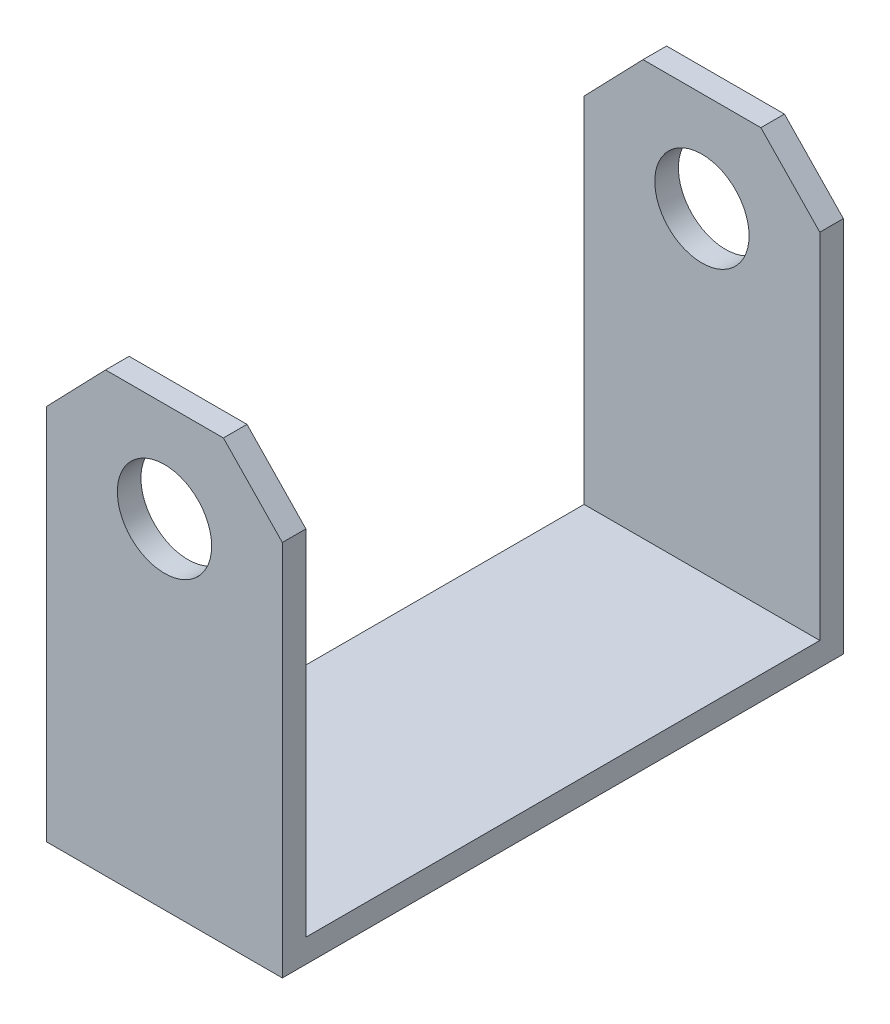
ISO-10303-21;
HEADER;
FILE_DESCRIPTION(('STEP AP214'),'2;1');
FILE_NAME('part.step','',(''),(''),'','','');
FILE_SCHEMA(('AUTOMOTIVE_DESIGN { 1 0 10303 214 1 1 1 1 }'));
ENDSEC;
DATA;
#1=APPLICATION_CONTEXT('core data for automotive mechanical design processes');
#2=APPLICATION_PROTOCOL_DEFINITION('international standard','automotive_design',2000,#1);
#3=PRODUCT_CONTEXT('',#1,'mechanical');
#4=PRODUCT('Part','Part','',(#3));
#5=PRODUCT_RELATED_PRODUCT_CATEGORY('part','',(#4));
#6=PRODUCT_DEFINITION_FORMATION('','',#4);
#7=PRODUCT_DEFINITION_CONTEXT('part definition',#1,'design');
#8=PRODUCT_DEFINITION('design','',#6,#7);
#9=PRODUCT_DEFINITION_SHAPE('','',#8);
#10=(LENGTH_UNIT() NAMED_UNIT(*) SI_UNIT(.MILLI.,.METRE.));
#11=(NAMED_UNIT(*) PLANE_ANGLE_UNIT() SI_UNIT($,.RADIAN.));
#12=(NAMED_UNIT(*) SI_UNIT($,.STERADIAN.) SOLID_ANGLE_UNIT());
#13=UNCERTAINTY_MEASURE_WITH_UNIT(LENGTH_MEASURE(1.E-05),#10,'distance_accuracy_value','');
#14=(GEOMETRIC_REPRESENTATION_CONTEXT(3) GLOBAL_UNCERTAINTY_ASSIGNED_CONTEXT((#13)) GLOBAL_UNIT_ASSIGNED_CONTEXT((#10,
#11,#12)) REPRESENTATION_CONTEXT('',''));
#15=CARTESIAN_POINT('',(0.,0.,0.));
#16=DIRECTION('',(0.,0.,1.));
#17=DIRECTION('',(1.,0.,0.));
#18=AXIS2_PLACEMENT_3D('',#15,#16,#17);
#19=CARTESIAN_POINT('',(0.,0.,1.27));
#20=DIRECTION('',(0.,0.,1.));
#21=DIRECTION('',(1.,0.,0.));
#22=AXIS2_PLACEMENT_3D('',#19,#20,#21);
#23=PLANE('',#22);
#24=DIRECTION('',(-1.,0.,0.));
#25=VECTOR('',#24,1.);
#26=CARTESIAN_POINT('',(0.,1.27,1.27));
#27=LINE('',#26,#25);
#28=CARTESIAN_POINT('',(12.7,1.27,1.27));
#29=VERTEX_POINT('',#28);
#30=CARTESIAN_POINT('',(0.,1.27,1.27));
#31=VERTEX_POINT('',#30);
#32=EDGE_CURVE('E157',#29,#31,#27,.T.);
#33=ORIENTED_EDGE('',*,*,#32,.F.);
#34=DIRECTION('',(0.,1.,0.));
#35=VECTOR('',#34,1.);
#36=CARTESIAN_POINT('',(12.7,0.,1.27));
#37=LINE('',#36,#35);
#38=CARTESIAN_POINT('',(12.7,20.32,1.27));
#39=VERTEX_POINT('',#38);
#40=EDGE_CURVE('E102',#29,#39,#37,.T.);
#41=ORIENTED_EDGE('',*,*,#40,.T.);
#42=DIRECTION('',(-0.694444444444445,0.719546324832701,0.));
#43=VECTOR('',#42,1.);
#44=CARTESIAN_POINT('',(12.7,20.32,1.27));
#45=LINE('',#44,#43);
#46=CARTESIAN_POINT('',(9.525,23.6097657971351,1.27));
#47=VERTEX_POINT('',#46);
#48=EDGE_CURVE('E234',#39,#47,#45,.T.);
#49=ORIENTED_EDGE('',*,*,#48,.T.);
#50=DIRECTION('',(-1.,0.,0.));
#51=VECTOR('',#50,1.);
#52=CARTESIAN_POINT('',(9.525,23.6097657971351,1.27));
#53=LINE('',#52,#51);
#54=CARTESIAN_POINT('',(3.175,23.6097657971351,1.27));
#55=VERTEX_POINT('',#54);
#56=EDGE_CURVE('E237',#47,#55,#53,.T.);
#57=ORIENTED_EDGE('',*,*,#56,.T.);
#58=DIRECTION('',(-0.694444444444445,-0.719546324832701,0.));
#59=VECTOR('',#58,1.);
#60=CARTESIAN_POINT('',(3.175,23.6097657971351,1.27));
#61=LINE('',#60,#59);
#62=CARTESIAN_POINT('',(0.,20.32,1.27));
#63=VERTEX_POINT('',#62);
#64=EDGE_CURVE('E69',#55,#63,#61,.T.);
#65=ORIENTED_EDGE('',*,*,#64,.T.);
#66=DIRECTION('',(0.,-1.,0.));
#67=VECTOR('',#66,1.);
#68=CARTESIAN_POINT('',(0.,20.32,1.27));
#69=LINE('',#68,#67);
#70=EDGE_CURVE('E229',#63,#31,#69,.T.);
#71=ORIENTED_EDGE('',*,*,#70,.T.);
#72=EDGE_LOOP('',(#33,#41,#49,#57,#65,#71));
#73=FACE_BOUND('',#72,.T.);
#74=CARTESIAN_POINT('',(6.35,18.2461449039246,1.27));
#75=DIRECTION('',(0.,0.,1.));
#76=DIRECTION('',(1.,0.,0.));
#77=AXIS2_PLACEMENT_3D('',#74,#75,#76);
#78=CIRCLE('',#77,2.54);
#79=CARTESIAN_POINT('',(8.89,18.2461449039246,1.27));
#80=VERTEX_POINT('',#79);
#81=EDGE_CURVE('E221',#80,#80,#78,.T.);
#82=ORIENTED_EDGE('',*,*,#81,.F.);
#83=EDGE_LOOP('',(#82));
#84=FACE_BOUND('',#83,.T.);
#85=ADVANCED_FACE('F45',(#73,#84),#23,.T.);
#86=CARTESIAN_POINT('',(0.,0.,0.));
#87=DIRECTION('',(0.,0.,1.));
#88=DIRECTION('',(1.,0.,0.));
#89=AXIS2_PLACEMENT_3D('',#86,#87,#88);
#90=PLANE('',#89);
#91=DIRECTION('',(0.,-1.,0.));
#92=VECTOR('',#91,1.);
#93=CARTESIAN_POINT('',(0.,20.32,0.));
#94=LINE('',#93,#92);
#95=CARTESIAN_POINT('',(0.,20.32,0.));
#96=VERTEX_POINT('',#95);
#97=CARTESIAN_POINT('',(0.,0.,0.));
#98=VERTEX_POINT('',#97);
#99=EDGE_CURVE('E225',#96,#98,#94,.T.);
#100=ORIENTED_EDGE('',*,*,#99,.F.);
#101=DIRECTION('',(-0.694444444444445,-0.719546324832701,0.));
#102=VECTOR('',#101,1.);
#103=CARTESIAN_POINT('',(3.175,23.6097657971351,0.));
#104=LINE('',#103,#102);
#105=CARTESIAN_POINT('',(3.175,23.6097657971351,0.));
#106=VERTEX_POINT('',#105);
#107=EDGE_CURVE('E96',#106,#96,#104,.T.);
#108=ORIENTED_EDGE('',*,*,#107,.F.);
#109=DIRECTION('',(-1.,0.,0.));
#110=VECTOR('',#109,1.);
#111=CARTESIAN_POINT('',(9.525,23.6097657971351,0.));
#112=LINE('',#111,#110);
#113=CARTESIAN_POINT('',(9.525,23.6097657971351,0.));
#114=VERTEX_POINT('',#113);
#115=EDGE_CURVE('E255',#114,#106,#112,.T.);
#116=ORIENTED_EDGE('',*,*,#115,.F.);
#117=DIRECTION('',(-0.694444444444445,0.719546324832701,0.));
#118=VECTOR('',#117,1.);
#119=CARTESIAN_POINT('',(12.7,20.32,0.));
#120=LINE('',#119,#118);
#121=CARTESIAN_POINT('',(12.7,20.32,0.));
#122=VERTEX_POINT('',#121);
#123=EDGE_CURVE('E252',#122,#114,#120,.T.);
#124=ORIENTED_EDGE('',*,*,#123,.F.);
#125=DIRECTION('',(0.,1.,0.));
#126=VECTOR('',#125,1.);
#127=CARTESIAN_POINT('',(12.7,0.,0.));
#128=LINE('',#127,#126);
#129=CARTESIAN_POINT('',(12.7,0.,0.));
#130=VERTEX_POINT('',#129);
#131=EDGE_CURVE('E249',#130,#122,#128,.T.);
#132=ORIENTED_EDGE('',*,*,#131,.F.);
#133=DIRECTION('',(1.,0.,0.));
#134=VECTOR('',#133,1.);
#135=CARTESIAN_POINT('',(0.,0.,0.));
#136=LINE('',#135,#134);
#137=EDGE_CURVE('E245',#98,#130,#136,.T.);
#138=ORIENTED_EDGE('',*,*,#137,.F.);
#139=EDGE_LOOP('',(#100,#108,#116,#124,#132,#138));
#140=FACE_BOUND('',#139,.T.);
#141=CARTESIAN_POINT('',(6.35,18.2461449039246,0.));
#142=DIRECTION('',(0.,0.,1.));
#143=DIRECTION('',(1.,0.,0.));
#144=AXIS2_PLACEMENT_3D('',#141,#142,#143);
#145=CIRCLE('',#144,2.54);
#146=CARTESIAN_POINT('',(8.89,18.2461449039246,0.));
#147=VERTEX_POINT('',#146);
#148=EDGE_CURVE('E220',#147,#147,#145,.T.);
#149=ORIENTED_EDGE('',*,*,#148,.T.);
#150=EDGE_LOOP('',(#149));
#151=FACE_BOUND('',#150,.T.);
#152=ADVANCED_FACE('F283',(#140,#151),#90,.F.);
#153=CARTESIAN_POINT('',(0.,20.32,1.27));
#154=DIRECTION('',(1.,0.,0.));
#155=DIRECTION('',(0.,0.,-1.));
#156=AXIS2_PLACEMENT_3D('',#153,#154,#155);
#157=PLANE('',#156);
#158=ORIENTED_EDGE('',*,*,#99,.T.);
#159=DIRECTION('',(0.,0.,-1.));
#160=VECTOR('',#159,1.);
#161=CARTESIAN_POINT('',(0.,0.,1.27));
#162=LINE('',#161,#160);
#163=CARTESIAN_POINT('',(0.,0.,30.226));
#164=VERTEX_POINT('',#163);
#165=EDGE_CURVE('E54',#164,#98,#162,.T.);
#166=ORIENTED_EDGE('',*,*,#165,.F.);
#167=DIRECTION('',(0.,-1.,0.));
#168=VECTOR('',#167,1.);
#169=CARTESIAN_POINT('',(0.,0.,30.226));
#170=LINE('',#169,#168);
#171=CARTESIAN_POINT('',(0.,20.32,30.226));
#172=VERTEX_POINT('',#171);
#173=EDGE_CURVE('E151',#172,#164,#170,.T.);
#174=ORIENTED_EDGE('',*,*,#173,.F.);
#175=DIRECTION('',(0.,0.,1.));
#176=VECTOR('',#175,1.);
#177=CARTESIAN_POINT('',(0.,20.32,28.956));
#178=LINE('',#177,#176);
#179=CARTESIAN_POINT('',(0.,20.32,28.956));
#180=VERTEX_POINT('',#179);
#181=EDGE_CURVE('E145',#180,#172,#178,.T.);
#182=ORIENTED_EDGE('',*,*,#181,.F.);
#183=DIRECTION('',(0.,-1.,0.));
#184=VECTOR('',#183,1.);
#185=CARTESIAN_POINT('',(0.,20.32,28.956));
#186=LINE('',#185,#184);
#187=CARTESIAN_POINT('',(0.,1.27,28.956));
#188=VERTEX_POINT('',#187);
#189=EDGE_CURVE('E148',#180,#188,#186,.T.);
#190=ORIENTED_EDGE('',*,*,#189,.T.);
#191=DIRECTION('',(0.,0.,-1.));
#192=VECTOR('',#191,1.);
#193=CARTESIAN_POINT('',(0.,1.27,30.226));
#194=LINE('',#193,#192);
#195=EDGE_CURVE('E213',#188,#31,#194,.T.);
#196=ORIENTED_EDGE('',*,*,#195,.T.);
#197=ORIENTED_EDGE('',*,*,#70,.F.);
#198=DIRECTION('',(0.,0.,-1.));
#199=VECTOR('',#198,1.);
#200=CARTESIAN_POINT('',(0.,20.32,1.27));
#201=LINE('',#200,#199);
#202=EDGE_CURVE('E242',#63,#96,#201,.T.);
#203=ORIENTED_EDGE('',*,*,#202,.T.);
#204=EDGE_LOOP('',(#158,#166,#174,#182,#190,#196,#197,#203));
#205=FACE_BOUND('',#204,.T.);
#206=ADVANCED_FACE('F47',(#205),#157,.F.);
#207=CARTESIAN_POINT('',(0.,0.,1.27));
#208=DIRECTION('',(0.,1.,0.));
#209=DIRECTION('',(0.,0.,1.));
#210=AXIS2_PLACEMENT_3D('',#207,#208,#209);
#211=PLANE('',#210);
#212=ORIENTED_EDGE('',*,*,#137,.T.);
#213=DIRECTION('',(0.,0.,-1.));
#214=VECTOR('',#213,1.);
#215=CARTESIAN_POINT('',(12.7,0.,1.27));
#216=LINE('',#215,#214);
#217=CARTESIAN_POINT('',(12.7,0.,30.226));
#218=VERTEX_POINT('',#217);
#219=EDGE_CURVE('E273',#218,#130,#216,.T.);
#220=ORIENTED_EDGE('',*,*,#219,.F.);
#221=DIRECTION('',(1.,0.,0.));
#222=VECTOR('',#221,1.);
#223=CARTESIAN_POINT('',(0.,0.,30.226));
#224=LINE('',#223,#222);
#225=EDGE_CURVE('E206',#164,#218,#224,.T.);
#226=ORIENTED_EDGE('',*,*,#225,.F.);
#227=ORIENTED_EDGE('',*,*,#165,.T.);
#228=EDGE_LOOP('',(#212,#220,#226,#227));
#229=FACE_BOUND('',#228,.T.);
#230=ADVANCED_FACE('F279',(#229),#211,.F.);
#231=CARTESIAN_POINT('',(12.7,0.,1.27));
#232=DIRECTION('',(-1.,0.,0.));
#233=DIRECTION('',(0.,0.,1.));
#234=AXIS2_PLACEMENT_3D('',#231,#232,#233);
#235=PLANE('',#234);
#236=DIRECTION('',(0.,0.,-1.));
#237=VECTOR('',#236,1.);
#238=CARTESIAN_POINT('',(12.7,1.27,30.226));
#239=LINE('',#238,#237);
#240=CARTESIAN_POINT('',(12.7,1.27,28.956));
#241=VERTEX_POINT('',#240);
#242=EDGE_CURVE('E60',#241,#29,#239,.T.);
#243=ORIENTED_EDGE('',*,*,#242,.F.);
#244=DIRECTION('',(0.,1.,0.));
#245=VECTOR('',#244,1.);
#246=CARTESIAN_POINT('',(12.7,0.,28.956));
#247=LINE('',#246,#245);
#248=CARTESIAN_POINT('',(12.7,20.32,28.956));
#249=VERTEX_POINT('',#248);
#250=EDGE_CURVE('E181',#241,#249,#247,.T.);
#251=ORIENTED_EDGE('',*,*,#250,.T.);
#252=DIRECTION('',(0.,0.,1.));
#253=VECTOR('',#252,1.);
#254=CARTESIAN_POINT('',(12.7,20.32,28.956));
#255=LINE('',#254,#253);
#256=CARTESIAN_POINT('',(12.7,20.32,30.226));
#257=VERTEX_POINT('',#256);
#258=EDGE_CURVE('E184',#249,#257,#255,.T.);
#259=ORIENTED_EDGE('',*,*,#258,.T.);
#260=DIRECTION('',(0.,1.,0.));
#261=VECTOR('',#260,1.);
#262=CARTESIAN_POINT('',(12.7,0.,30.226));
#263=LINE('',#262,#261);
#264=EDGE_CURVE('E210',#218,#257,#263,.T.);
#265=ORIENTED_EDGE('',*,*,#264,.F.);
#266=ORIENTED_EDGE('',*,*,#219,.T.);
#267=ORIENTED_EDGE('',*,*,#131,.T.);
#268=DIRECTION('',(0.,0.,-1.));
#269=VECTOR('',#268,1.);
#270=CARTESIAN_POINT('',(12.7,20.32,1.27));
#271=LINE('',#270,#269);
#272=EDGE_CURVE('E269',#39,#122,#271,.T.);
#273=ORIENTED_EDGE('',*,*,#272,.F.);
#274=ORIENTED_EDGE('',*,*,#40,.F.);
#275=EDGE_LOOP('',(#243,#251,#259,#265,#266,#267,#273,#274));
#276=FACE_BOUND('',#275,.T.);
#277=ADVANCED_FACE('F298',(#276),#235,.F.);
#278=CARTESIAN_POINT('',(12.7,20.32,1.27));
#279=DIRECTION('',(-0.719546324832701,-0.694444444444445,0.));
#280=DIRECTION('',(0.694444444444445,-0.719546324832701,0.));
#281=AXIS2_PLACEMENT_3D('',#278,#279,#280);
#282=PLANE('',#281);
#283=ORIENTED_EDGE('',*,*,#123,.T.);
#284=DIRECTION('',(0.,0.,-1.));
#285=VECTOR('',#284,1.);
#286=CARTESIAN_POINT('',(9.525,23.6097657971351,1.27));
#287=LINE('',#286,#285);
#288=EDGE_CURVE('E265',#47,#114,#287,.T.);
#289=ORIENTED_EDGE('',*,*,#288,.F.);
#290=ORIENTED_EDGE('',*,*,#48,.F.);
#291=ORIENTED_EDGE('',*,*,#272,.T.);
#292=EDGE_LOOP('',(#283,#289,#290,#291));
#293=FACE_BOUND('',#292,.T.);
#294=ADVANCED_FACE('F296',(#293),#282,.F.);
#295=CARTESIAN_POINT('',(9.525,23.6097657971351,1.27));
#296=DIRECTION('',(0.,-1.,0.));
#297=DIRECTION('',(0.,0.,-1.));
#298=AXIS2_PLACEMENT_3D('',#295,#296,#297);
#299=PLANE('',#298);
#300=ORIENTED_EDGE('',*,*,#115,.T.);
#301=DIRECTION('',(0.,0.,-1.));
#302=VECTOR('',#301,1.);
#303=CARTESIAN_POINT('',(3.175,23.6097657971351,1.27));
#304=LINE('',#303,#302);
#305=EDGE_CURVE('E262',#55,#106,#304,.T.);
#306=ORIENTED_EDGE('',*,*,#305,.F.);
#307=ORIENTED_EDGE('',*,*,#56,.F.);
#308=ORIENTED_EDGE('',*,*,#288,.T.);
#309=EDGE_LOOP('',(#300,#306,#307,#308));
#310=FACE_BOUND('',#309,.T.);
#311=ADVANCED_FACE('F292',(#310),#299,.F.);
#312=CARTESIAN_POINT('',(3.175,23.6097657971351,1.27));
#313=DIRECTION('',(0.719546324832701,-0.694444444444445,0.));
#314=DIRECTION('',(0.694444444444445,0.719546324832701,0.));
#315=AXIS2_PLACEMENT_3D('',#312,#313,#314);
#316=PLANE('',#315);
#317=ORIENTED_EDGE('',*,*,#107,.T.);
#318=ORIENTED_EDGE('',*,*,#202,.F.);
#319=ORIENTED_EDGE('',*,*,#64,.F.);
#320=ORIENTED_EDGE('',*,*,#305,.T.);
#321=EDGE_LOOP('',(#317,#318,#319,#320));
#322=FACE_BOUND('',#321,.T.);
#323=ADVANCED_FACE('F287',(#322),#316,.F.);
#324=CARTESIAN_POINT('',(6.35,18.2461449039246,1.27));
#325=DIRECTION('',(0.,0.,-1.));
#326=DIRECTION('',(-1.,0.,0.));
#327=AXIS2_PLACEMENT_3D('',#324,#325,#326);
#328=CYLINDRICAL_SURFACE('',#327,2.54);
#329=ORIENTED_EDGE('',*,*,#81,.T.);
#330=EDGE_LOOP('',(#329));
#331=FACE_BOUND('',#330,.T.);
#332=ORIENTED_EDGE('',*,*,#148,.F.);
#333=EDGE_LOOP('',(#332));
#334=FACE_BOUND('',#333,.T.);
#335=ADVANCED_FACE('F317',(#331,#334),#328,.F.);
#336=CARTESIAN_POINT('',(0.,1.27,30.226));
#337=DIRECTION('',(0.,-1.,0.));
#338=DIRECTION('',(0.,0.,-1.));
#339=AXIS2_PLACEMENT_3D('',#336,#337,#338);
#340=PLANE('',#339);
#341=ORIENTED_EDGE('',*,*,#195,.F.);
#342=DIRECTION('',(1.,0.,0.));
#343=VECTOR('',#342,1.);
#344=CARTESIAN_POINT('',(0.,1.27,28.956));
#345=LINE('',#344,#343);
#346=EDGE_CURVE('E11',#188,#241,#345,.T.);
#347=ORIENTED_EDGE('',*,*,#346,.T.);
#348=ORIENTED_EDGE('',*,*,#242,.T.);
#349=ORIENTED_EDGE('',*,*,#32,.T.);
#350=EDGE_LOOP('',(#341,#347,#348,#349));
#351=FACE_BOUND('',#350,.T.);
#352=ADVANCED_FACE('F311',(#351),#340,.F.);
#353=CARTESIAN_POINT('',(0.,0.,30.226));
#354=DIRECTION('',(0.,0.,-1.));
#355=DIRECTION('',(-1.,0.,0.));
#356=AXIS2_PLACEMENT_3D('',#353,#354,#355);
#357=PLANE('',#356);
#358=ORIENTED_EDGE('',*,*,#173,.T.);
#359=ORIENTED_EDGE('',*,*,#225,.T.);
#360=ORIENTED_EDGE('',*,*,#264,.T.);
#361=DIRECTION('',(-0.694444444444445,0.719546324832701,0.));
#362=VECTOR('',#361,1.);
#363=CARTESIAN_POINT('',(12.7,20.32,30.226));
#364=LINE('',#363,#362);
#365=CARTESIAN_POINT('',(9.525,23.6097657971351,30.226));
#366=VERTEX_POINT('',#365);
#367=EDGE_CURVE('E167',#257,#366,#364,.T.);
#368=ORIENTED_EDGE('',*,*,#367,.T.);
#369=DIRECTION('',(-1.,0.,0.));
#370=VECTOR('',#369,1.);
#371=CARTESIAN_POINT('',(9.525,23.6097657971351,30.226));
#372=LINE('',#371,#370);
#373=CARTESIAN_POINT('',(3.175,23.6097657971351,30.226));
#374=VERTEX_POINT('',#373);
#375=EDGE_CURVE('E188',#366,#374,#372,.T.);
#376=ORIENTED_EDGE('',*,*,#375,.T.);
#377=DIRECTION('',(-0.694444444444445,-0.719546324832701,0.));
#378=VECTOR('',#377,1.);
#379=CARTESIAN_POINT('',(3.175,23.6097657971351,30.226));
#380=LINE('',#379,#378);
#381=EDGE_CURVE('E185',#374,#172,#380,.T.);
#382=ORIENTED_EDGE('',*,*,#381,.T.);
#383=EDGE_LOOP('',(#358,#359,#360,#368,#376,#382));
#384=FACE_BOUND('',#383,.T.);
#385=CARTESIAN_POINT('',(6.35,18.2461449039246,30.226));
#386=DIRECTION('',(0.,0.,1.));
#387=DIRECTION('',(1.,0.,0.));
#388=AXIS2_PLACEMENT_3D('',#385,#386,#387);
#389=CIRCLE('',#388,2.54);
#390=CARTESIAN_POINT('',(8.89,18.2461449039246,30.226));
#391=VERTEX_POINT('',#390);
#392=EDGE_CURVE('E470',#391,#391,#389,.T.);
#393=ORIENTED_EDGE('',*,*,#392,.F.);
#394=EDGE_LOOP('',(#393));
#395=FACE_BOUND('',#394,.T.);
#396=ADVANCED_FACE('F301',(#384,#395),#357,.F.);
#397=CARTESIAN_POINT('',(0.,0.,28.956));
#398=DIRECTION('',(0.,0.,-1.));
#399=DIRECTION('',(1.,0.,0.));
#400=AXIS2_PLACEMENT_3D('',#397,#398,#399);
#401=PLANE('',#400);
#402=CARTESIAN_POINT('',(6.35,18.2461449039246,28.956));
#403=DIRECTION('',(0.,0.,1.));
#404=DIRECTION('',(1.,0.,0.));
#405=AXIS2_PLACEMENT_3D('',#402,#403,#404);
#406=CIRCLE('',#405,2.54);
#407=CARTESIAN_POINT('',(8.89,18.2461449039246,28.956));
#408=VERTEX_POINT('',#407);
#409=EDGE_CURVE('E189',#408,#408,#406,.T.);
#410=ORIENTED_EDGE('',*,*,#409,.T.);
#411=EDGE_LOOP('',(#410));
#412=FACE_BOUND('',#411,.T.);
#413=ORIENTED_EDGE('',*,*,#346,.F.);
#414=ORIENTED_EDGE('',*,*,#189,.F.);
#415=DIRECTION('',(-0.694444444444445,-0.719546324832701,0.));
#416=VECTOR('',#415,1.);
#417=CARTESIAN_POINT('',(3.175,23.6097657971351,28.956));
#418=LINE('',#417,#416);
#419=CARTESIAN_POINT('',(3.175,23.6097657971351,28.956));
#420=VERTEX_POINT('',#419);
#421=EDGE_CURVE('E164',#420,#180,#418,.T.);
#422=ORIENTED_EDGE('',*,*,#421,.F.);
#423=DIRECTION('',(-1.,0.,0.));
#424=VECTOR('',#423,1.);
#425=CARTESIAN_POINT('',(9.525,23.6097657971351,28.956));
#426=LINE('',#425,#424);
#427=CARTESIAN_POINT('',(9.525,23.6097657971351,28.956));
#428=VERTEX_POINT('',#427);
#429=EDGE_CURVE('E171',#428,#420,#426,.T.);
#430=ORIENTED_EDGE('',*,*,#429,.F.);
#431=DIRECTION('',(-0.694444444444445,0.719546324832701,0.));
#432=VECTOR('',#431,1.);
#433=CARTESIAN_POINT('',(12.7,20.32,28.956));
#434=LINE('',#433,#432);
#435=EDGE_CURVE('E174',#249,#428,#434,.T.);
#436=ORIENTED_EDGE('',*,*,#435,.F.);
#437=ORIENTED_EDGE('',*,*,#250,.F.);
#438=EDGE_LOOP('',(#413,#414,#422,#430,#436,#437));
#439=FACE_BOUND('',#438,.T.);
#440=ADVANCED_FACE('F162',(#412,#439),#401,.T.);
#441=CARTESIAN_POINT('',(3.175,23.6097657971351,28.956));
#442=DIRECTION('',(-0.719546324832701,0.694444444444445,0.));
#443=DIRECTION('',(-0.694444444444445,-0.719546324832701,0.));
#444=AXIS2_PLACEMENT_3D('',#441,#442,#443);
#445=PLANE('',#444);
#446=ORIENTED_EDGE('',*,*,#381,.F.);
#447=DIRECTION('',(0.,0.,1.));
#448=VECTOR('',#447,1.);
#449=CARTESIAN_POINT('',(3.175,23.6097657971351,28.956));
#450=LINE('',#449,#448);
#451=EDGE_CURVE('E158',#420,#374,#450,.T.);
#452=ORIENTED_EDGE('',*,*,#451,.F.);
#453=ORIENTED_EDGE('',*,*,#421,.T.);
#454=ORIENTED_EDGE('',*,*,#181,.T.);
#455=EDGE_LOOP('',(#446,#452,#453,#454));
#456=FACE_BOUND('',#455,.T.);
#457=ADVANCED_FACE('F169',(#456),#445,.T.);
#458=CARTESIAN_POINT('',(9.525,23.6097657971351,28.956));
#459=DIRECTION('',(0.,1.,0.));
#460=DIRECTION('',(0.,0.,1.));
#461=AXIS2_PLACEMENT_3D('',#458,#459,#460);
#462=PLANE('',#461);
#463=ORIENTED_EDGE('',*,*,#375,.F.);
#464=DIRECTION('',(0.,0.,1.));
#465=VECTOR('',#464,1.);
#466=CARTESIAN_POINT('',(9.525,23.6097657971351,28.956));
#467=LINE('',#466,#465);
#468=EDGE_CURVE('E199',#428,#366,#467,.T.);
#469=ORIENTED_EDGE('',*,*,#468,.F.);
#470=ORIENTED_EDGE('',*,*,#429,.T.);
#471=ORIENTED_EDGE('',*,*,#451,.T.);
#472=EDGE_LOOP('',(#463,#469,#470,#471));
#473=FACE_BOUND('',#472,.T.);
#474=ADVANCED_FACE('F306',(#473),#462,.T.);
#475=CARTESIAN_POINT('',(12.7,20.32,28.956));
#476=DIRECTION('',(0.719546324832701,0.694444444444445,0.));
#477=DIRECTION('',(-0.694444444444445,0.719546324832701,0.));
#478=AXIS2_PLACEMENT_3D('',#475,#476,#477);
#479=PLANE('',#478);
#480=ORIENTED_EDGE('',*,*,#367,.F.);
#481=ORIENTED_EDGE('',*,*,#258,.F.);
#482=ORIENTED_EDGE('',*,*,#435,.T.);
#483=ORIENTED_EDGE('',*,*,#468,.T.);
#484=EDGE_LOOP('',(#480,#481,#482,#483));
#485=FACE_BOUND('',#484,.T.);
#486=ADVANCED_FACE('F310',(#485),#479,.T.);
#487=CARTESIAN_POINT('',(6.35,18.2461449039246,28.956));
#488=DIRECTION('',(0.,0.,1.));
#489=DIRECTION('',(1.,0.,0.));
#490=AXIS2_PLACEMENT_3D('',#487,#488,#489);
#491=CYLINDRICAL_SURFACE('',#490,2.54);
#492=ORIENTED_EDGE('',*,*,#409,.F.);
#493=EDGE_LOOP('',(#492));
#494=FACE_BOUND('',#493,.T.);
#495=ORIENTED_EDGE('',*,*,#392,.T.);
#496=EDGE_LOOP('',(#495));
#497=FACE_BOUND('',#496,.T.);
#498=ADVANCED_FACE('F389',(#494,#497),#491,.F.);
#499=CLOSED_SHELL('',(#85,#152,#206,#230,#277,#294,#311,#323,#335,#352,#396,#440,#457,#474,#486,#498));
#500=MANIFOLD_SOLID_BREP('B2',#499);
#501=ADVANCED_BREP_SHAPE_REPRESENTATION('',(#18,#500),#14);
#502=SHAPE_DEFINITION_REPRESENTATION(#9,#501);
ENDSEC;
END-ISO-10303-21;
